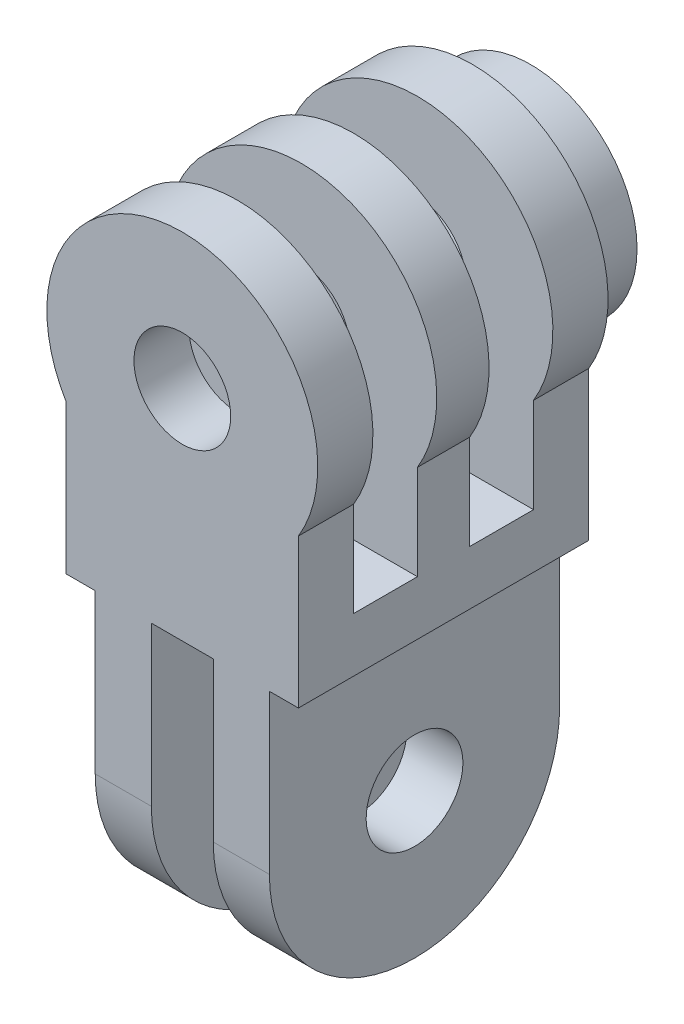
ISO-10303-21;
HEADER;
FILE_DESCRIPTION(('STEP AP214'),'2;1');
FILE_NAME('part.step','',(''),(''),'','','');
FILE_SCHEMA(('AUTOMOTIVE_DESIGN { 1 0 10303 214 1 1 1 1 }'));
ENDSEC;
DATA;
#1=APPLICATION_CONTEXT('core data for automotive mechanical design processes');
#2=APPLICATION_PROTOCOL_DEFINITION('international standard','automotive_design',2000,#1);
#3=PRODUCT_CONTEXT('',#1,'mechanical');
#4=PRODUCT('Part','Part','',(#3));
#5=PRODUCT_RELATED_PRODUCT_CATEGORY('part','',(#4));
#6=PRODUCT_DEFINITION_FORMATION('','',#4);
#7=PRODUCT_DEFINITION_CONTEXT('part definition',#1,'design');
#8=PRODUCT_DEFINITION('design','',#6,#7);
#9=PRODUCT_DEFINITION_SHAPE('','',#8);
#10=(LENGTH_UNIT() NAMED_UNIT(*) SI_UNIT(.MILLI.,.METRE.));
#11=(NAMED_UNIT(*) PLANE_ANGLE_UNIT() SI_UNIT($,.RADIAN.));
#12=(NAMED_UNIT(*) SI_UNIT($,.STERADIAN.) SOLID_ANGLE_UNIT());
#13=UNCERTAINTY_MEASURE_WITH_UNIT(LENGTH_MEASURE(1.E-05),#10,'distance_accuracy_value','');
#14=(GEOMETRIC_REPRESENTATION_CONTEXT(3) GLOBAL_UNCERTAINTY_ASSIGNED_CONTEXT((#13)) GLOBAL_UNIT_ASSIGNED_CONTEXT((#10,
#11,#12)) REPRESENTATION_CONTEXT('',''));
#15=CARTESIAN_POINT('',(0.,0.,0.));
#16=DIRECTION('',(0.,0.,1.));
#17=DIRECTION('',(1.,0.,0.));
#18=AXIS2_PLACEMENT_3D('',#15,#16,#17);
#19=CARTESIAN_POINT('',(0.,0.,0.));
#20=DIRECTION('',(0.,0.,1.));
#21=DIRECTION('',(1.,0.,0.));
#22=AXIS2_PLACEMENT_3D('',#19,#20,#21);
#23=PLANE('',#22);
#24=DIRECTION('',(1.,0.,0.));
#25=VECTOR('',#24,1.);
#26=CARTESIAN_POINT('',(-5.5,-9.50000000000001,0.));
#27=LINE('',#26,#25);
#28=CARTESIAN_POINT('',(-4.5,-9.50000000000001,0.));
#29=VERTEX_POINT('',#28);
#30=CARTESIAN_POINT('',(-1.6,-9.50000000000001,0.));
#31=VERTEX_POINT('',#30);
#32=EDGE_CURVE('E68',#29,#31,#27,.T.);
#33=ORIENTED_EDGE('',*,*,#32,.F.);
#34=DIRECTION('',(0.,-1.,0.));
#35=VECTOR('',#34,1.);
#36=CARTESIAN_POINT('',(-4.5,0.,0.));
#37=LINE('',#36,#35);
#38=CARTESIAN_POINT('',(-4.5,-1.30259838574965,0.));
#39=VERTEX_POINT('',#38);
#40=EDGE_CURVE('E408',#39,#29,#37,.T.);
#41=ORIENTED_EDGE('',*,*,#40,.F.);
#42=DIRECTION('',(1.,0.,0.));
#43=VECTOR('',#42,1.);
#44=CARTESIAN_POINT('',(0.,-1.30259838574965,0.));
#45=LINE('',#44,#43);
#46=CARTESIAN_POINT('',(-6.,-1.30259838574965,0.));
#47=VERTEX_POINT('',#46);
#48=EDGE_CURVE('E406',#47,#39,#45,.T.);
#49=ORIENTED_EDGE('',*,*,#48,.F.);
#50=DIRECTION('',(0.,1.,0.));
#51=VECTOR('',#50,1.);
#52=CARTESIAN_POINT('',(-6.,0.,0.));
#53=LINE('',#52,#51);
#54=CARTESIAN_POINT('',(-6.,6.394448724536,0.));
#55=VERTEX_POINT('',#54);
#56=EDGE_CURVE('E403',#47,#55,#53,.T.);
#57=ORIENTED_EDGE('',*,*,#56,.T.);
#58=CARTESIAN_POINT('',(0.,10.,0.));
#59=DIRECTION('',(0.,0.,1.));
#60=DIRECTION('',(1.,0.,0.));
#61=AXIS2_PLACEMENT_3D('',#58,#59,#60);
#62=CIRCLE('',#61,7.);
#63=CARTESIAN_POINT('',(6.,6.39444872453601,0.));
#64=VERTEX_POINT('',#63);
#65=EDGE_CURVE('E400',#64,#55,#62,.T.);
#66=ORIENTED_EDGE('',*,*,#65,.F.);
#67=DIRECTION('',(0.,1.,0.));
#68=VECTOR('',#67,1.);
#69=CARTESIAN_POINT('',(6.,0.,0.));
#70=LINE('',#69,#68);
#71=CARTESIAN_POINT('',(6.,-1.30259838574965,0.));
#72=VERTEX_POINT('',#71);
#73=EDGE_CURVE('E366',#72,#64,#70,.T.);
#74=ORIENTED_EDGE('',*,*,#73,.F.);
#75=DIRECTION('',(-1.,0.,0.));
#76=VECTOR('',#75,1.);
#77=CARTESIAN_POINT('',(0.,-1.30259838574965,0.));
#78=LINE('',#77,#76);
#79=CARTESIAN_POINT('',(4.5,-1.30259838574965,0.));
#80=VERTEX_POINT('',#79);
#81=EDGE_CURVE('E371',#72,#80,#78,.T.);
#82=ORIENTED_EDGE('',*,*,#81,.T.);
#83=DIRECTION('',(0.,-1.,0.));
#84=VECTOR('',#83,1.);
#85=CARTESIAN_POINT('',(4.5,0.,0.));
#86=LINE('',#85,#84);
#87=CARTESIAN_POINT('',(4.5,-9.50000000000001,0.));
#88=VERTEX_POINT('',#87);
#89=EDGE_CURVE('E418',#80,#88,#86,.T.);
#90=ORIENTED_EDGE('',*,*,#89,.T.);
#91=CARTESIAN_POINT('',(1.6,-9.50000000000001,0.));
#92=VERTEX_POINT('',#91);
#93=EDGE_CURVE('E462',#92,#88,#27,.T.);
#94=ORIENTED_EDGE('',*,*,#93,.F.);
#95=DIRECTION('',(0.,1.,0.));
#96=VECTOR('',#95,1.);
#97=CARTESIAN_POINT('',(1.6,0.,0.));
#98=LINE('',#97,#96);
#99=CARTESIAN_POINT('',(1.6,-1.30259838574965,0.));
#100=VERTEX_POINT('',#99);
#101=EDGE_CURVE('E416',#92,#100,#98,.T.);
#102=ORIENTED_EDGE('',*,*,#101,.T.);
#103=DIRECTION('',(-1.,0.,0.));
#104=VECTOR('',#103,1.);
#105=CARTESIAN_POINT('',(0.,-1.30259838574965,0.));
#106=LINE('',#105,#104);
#107=CARTESIAN_POINT('',(-1.6,-1.30259838574965,0.));
#108=VERTEX_POINT('',#107);
#109=EDGE_CURVE('E413',#100,#108,#106,.T.);
#110=ORIENTED_EDGE('',*,*,#109,.T.);
#111=DIRECTION('',(0.,1.,0.));
#112=VECTOR('',#111,1.);
#113=CARTESIAN_POINT('',(-1.6,0.,0.));
#114=LINE('',#113,#112);
#115=EDGE_CURVE('E411',#31,#108,#114,.T.);
#116=ORIENTED_EDGE('',*,*,#115,.F.);
#117=EDGE_LOOP('',(#33,#41,#49,#57,#66,#74,#82,#90,#94,#102,#110,#116));
#118=FACE_BOUND('',#117,.T.);
#119=CARTESIAN_POINT('',(0.,10.,0.));
#120=DIRECTION('',(0.,0.,1.));
#121=DIRECTION('',(1.,0.,0.));
#122=AXIS2_PLACEMENT_3D('',#119,#120,#121);
#123=CIRCLE('',#122,5.5);
#124=CARTESIAN_POINT('',(5.5,10.,0.));
#125=VERTEX_POINT('',#124);
#126=EDGE_CURVE('E12',#125,#125,#123,.F.);
#127=ORIENTED_EDGE('',*,*,#126,.F.);
#128=EDGE_LOOP('',(#127));
#129=FACE_BOUND('',#128,.T.);
#130=ADVANCED_FACE('F59',(#118,#129),#23,.F.);
#131=CARTESIAN_POINT('',(-4.5,0.,15.));
#132=DIRECTION('',(1.,0.,0.));
#133=DIRECTION('',(0.,1.,0.));
#134=AXIS2_PLACEMENT_3D('',#131,#132,#133);
#135=PLANE('',#134);
#136=CARTESIAN_POINT('',(-4.5,-9.50000000000001,7.5));
#137=DIRECTION('',(1.,0.,0.));
#138=DIRECTION('',(0.,1.,0.));
#139=AXIS2_PLACEMENT_3D('',#136,#137,#138);
#140=CIRCLE('',#139,2.5);
#141=CARTESIAN_POINT('',(-4.5,-7.00000000000001,7.5));
#142=VERTEX_POINT('',#141);
#143=EDGE_CURVE('E299',#142,#142,#140,.T.);
#144=ORIENTED_EDGE('',*,*,#143,.T.);
#145=EDGE_LOOP('',(#144));
#146=FACE_BOUND('',#145,.T.);
#147=ORIENTED_EDGE('',*,*,#40,.T.);
#148=CARTESIAN_POINT('',(-4.5,-9.50000000000001,7.5));
#149=DIRECTION('',(1.,0.,0.));
#150=DIRECTION('',(0.,1.,0.));
#151=AXIS2_PLACEMENT_3D('',#148,#149,#150);
#152=CIRCLE('',#151,7.5);
#153=CARTESIAN_POINT('',(-4.5,-9.50000000000001,15.));
#154=VERTEX_POINT('',#153);
#155=EDGE_CURVE('E308',#154,#29,#152,.T.);
#156=ORIENTED_EDGE('',*,*,#155,.F.);
#157=DIRECTION('',(0.,-1.,0.));
#158=VECTOR('',#157,1.);
#159=CARTESIAN_POINT('',(-4.5,0.,15.));
#160=LINE('',#159,#158);
#161=CARTESIAN_POINT('',(-4.5,-1.30259838574965,15.));
#162=VERTEX_POINT('',#161);
#163=EDGE_CURVE('E378',#162,#154,#160,.T.);
#164=ORIENTED_EDGE('',*,*,#163,.F.);
#165=DIRECTION('',(0.,0.,-1.));
#166=VECTOR('',#165,1.);
#167=CARTESIAN_POINT('',(-4.5,-1.30259838574965,15.));
#168=LINE('',#167,#166);
#169=EDGE_CURVE('E432',#162,#39,#168,.T.);
#170=ORIENTED_EDGE('',*,*,#169,.T.);
#171=EDGE_LOOP('',(#147,#156,#164,#170));
#172=FACE_BOUND('',#171,.T.);
#173=ADVANCED_FACE('F517',(#146,#172),#135,.F.);
#174=CARTESIAN_POINT('',(-1.6,0.,15.));
#175=DIRECTION('',(-1.,0.,0.));
#176=DIRECTION('',(0.,0.,1.));
#177=AXIS2_PLACEMENT_3D('',#174,#175,#176);
#178=PLANE('',#177);
#179=CARTESIAN_POINT('',(-1.6,-9.50000000000001,7.5));
#180=DIRECTION('',(-1.,0.,0.));
#181=DIRECTION('',(0.,0.,1.));
#182=AXIS2_PLACEMENT_3D('',#179,#180,#181);
#183=CIRCLE('',#182,2.5);
#184=CARTESIAN_POINT('',(-1.6,-9.50000000000001,10.));
#185=VERTEX_POINT('',#184);
#186=EDGE_CURVE('E296',#185,#185,#183,.T.);
#187=ORIENTED_EDGE('',*,*,#186,.T.);
#188=EDGE_LOOP('',(#187));
#189=FACE_BOUND('',#188,.T.);
#190=CARTESIAN_POINT('',(-1.6,-9.50000000000001,7.5));
#191=DIRECTION('',(-1.,0.,0.));
#192=DIRECTION('',(0.,0.,1.));
#193=AXIS2_PLACEMENT_3D('',#190,#191,#192);
#194=CIRCLE('',#193,7.5);
#195=CARTESIAN_POINT('',(-1.6,-9.50000000000001,15.));
#196=VERTEX_POINT('',#195);
#197=EDGE_CURVE('E306',#31,#196,#194,.T.);
#198=ORIENTED_EDGE('',*,*,#197,.F.);
#199=ORIENTED_EDGE('',*,*,#115,.T.);
#200=DIRECTION('',(0.,0.,-1.));
#201=VECTOR('',#200,1.);
#202=CARTESIAN_POINT('',(-1.6,-1.30259838574965,15.));
#203=LINE('',#202,#201);
#204=CARTESIAN_POINT('',(-1.6,-1.30259838574965,15.));
#205=VERTEX_POINT('',#204);
#206=EDGE_CURVE('E429',#205,#108,#203,.T.);
#207=ORIENTED_EDGE('',*,*,#206,.F.);
#208=DIRECTION('',(0.,1.,0.));
#209=VECTOR('',#208,1.);
#210=CARTESIAN_POINT('',(-1.6,0.,15.));
#211=LINE('',#210,#209);
#212=EDGE_CURVE('E381',#196,#205,#211,.T.);
#213=ORIENTED_EDGE('',*,*,#212,.F.);
#214=EDGE_LOOP('',(#198,#199,#207,#213));
#215=FACE_BOUND('',#214,.T.);
#216=ADVANCED_FACE('F475',(#189,#215),#178,.F.);
#217=CARTESIAN_POINT('',(1.6,0.,15.));
#218=DIRECTION('',(-1.,0.,0.));
#219=DIRECTION('',(0.,0.,1.));
#220=AXIS2_PLACEMENT_3D('',#217,#218,#219);
#221=PLANE('',#220);
#222=CARTESIAN_POINT('',(1.6,-9.50000000000001,7.5));
#223=DIRECTION('',(-1.,0.,0.));
#224=DIRECTION('',(0.,0.,1.));
#225=AXIS2_PLACEMENT_3D('',#222,#223,#224);
#226=CIRCLE('',#225,2.5);
#227=CARTESIAN_POINT('',(1.6,-9.50000000000001,10.));
#228=VERTEX_POINT('',#227);
#229=EDGE_CURVE('E293',#228,#228,#226,.T.);
#230=ORIENTED_EDGE('',*,*,#229,.F.);
#231=EDGE_LOOP('',(#230));
#232=FACE_BOUND('',#231,.T.);
#233=ORIENTED_EDGE('',*,*,#101,.F.);
#234=CARTESIAN_POINT('',(1.6,-9.50000000000001,7.5));
#235=DIRECTION('',(-1.,0.,0.));
#236=DIRECTION('',(0.,0.,1.));
#237=AXIS2_PLACEMENT_3D('',#234,#235,#236);
#238=CIRCLE('',#237,7.5);
#239=CARTESIAN_POINT('',(1.6,-9.50000000000001,15.));
#240=VERTEX_POINT('',#239);
#241=EDGE_CURVE('E303',#92,#240,#238,.T.);
#242=ORIENTED_EDGE('',*,*,#241,.T.);
#243=DIRECTION('',(0.,1.,0.));
#244=VECTOR('',#243,1.);
#245=CARTESIAN_POINT('',(1.6,0.,15.));
#246=LINE('',#245,#244);
#247=CARTESIAN_POINT('',(1.6,-1.30259838574965,15.));
#248=VERTEX_POINT('',#247);
#249=EDGE_CURVE('E386',#240,#248,#246,.T.);
#250=ORIENTED_EDGE('',*,*,#249,.T.);
#251=DIRECTION('',(0.,0.,-1.));
#252=VECTOR('',#251,1.);
#253=CARTESIAN_POINT('',(1.6,-1.30259838574965,15.));
#254=LINE('',#253,#252);
#255=EDGE_CURVE('E426',#248,#100,#254,.T.);
#256=ORIENTED_EDGE('',*,*,#255,.T.);
#257=EDGE_LOOP('',(#233,#242,#250,#256));
#258=FACE_BOUND('',#257,.T.);
#259=ADVANCED_FACE('F485',(#232,#258),#221,.T.);
#260=CARTESIAN_POINT('',(4.5,0.,15.));
#261=DIRECTION('',(1.,0.,0.));
#262=DIRECTION('',(0.,1.,0.));
#263=AXIS2_PLACEMENT_3D('',#260,#261,#262);
#264=PLANE('',#263);
#265=CARTESIAN_POINT('',(4.5,-9.50000000000001,7.5));
#266=DIRECTION('',(1.,0.,0.));
#267=DIRECTION('',(0.,1.,0.));
#268=AXIS2_PLACEMENT_3D('',#265,#266,#267);
#269=CIRCLE('',#268,2.5);
#270=CARTESIAN_POINT('',(4.5,-7.,7.5));
#271=VERTEX_POINT('',#270);
#272=EDGE_CURVE('E290',#271,#271,#269,.T.);
#273=ORIENTED_EDGE('',*,*,#272,.F.);
#274=EDGE_LOOP('',(#273));
#275=FACE_BOUND('',#274,.T.);
#276=CARTESIAN_POINT('',(4.5,-9.50000000000001,7.5));
#277=DIRECTION('',(1.,0.,0.));
#278=DIRECTION('',(0.,1.,0.));
#279=AXIS2_PLACEMENT_3D('',#276,#277,#278);
#280=CIRCLE('',#279,7.5);
#281=CARTESIAN_POINT('',(4.5,-9.50000000000001,15.));
#282=VERTEX_POINT('',#281);
#283=EDGE_CURVE('E83',#282,#88,#280,.T.);
#284=ORIENTED_EDGE('',*,*,#283,.T.);
#285=ORIENTED_EDGE('',*,*,#89,.F.);
#286=DIRECTION('',(0.,0.,-1.));
#287=VECTOR('',#286,1.);
#288=CARTESIAN_POINT('',(4.5,-1.30259838574965,15.));
#289=LINE('',#288,#287);
#290=CARTESIAN_POINT('',(4.5,-1.30259838574965,15.));
#291=VERTEX_POINT('',#290);
#292=EDGE_CURVE('E424',#291,#80,#289,.T.);
#293=ORIENTED_EDGE('',*,*,#292,.F.);
#294=DIRECTION('',(0.,-1.,0.));
#295=VECTOR('',#294,1.);
#296=CARTESIAN_POINT('',(4.5,0.,15.));
#297=LINE('',#296,#295);
#298=EDGE_CURVE('E388',#291,#282,#297,.T.);
#299=ORIENTED_EDGE('',*,*,#298,.T.);
#300=EDGE_LOOP('',(#284,#285,#293,#299));
#301=FACE_BOUND('',#300,.T.);
#302=ADVANCED_FACE('F494',(#275,#301),#264,.T.);
#303=CARTESIAN_POINT('',(0.,0.,15.));
#304=DIRECTION('',(0.,0.,1.));
#305=DIRECTION('',(1.,0.,0.));
#306=AXIS2_PLACEMENT_3D('',#303,#304,#305);
#307=PLANE('',#306);
#308=CARTESIAN_POINT('',(0.,10.,15.));
#309=DIRECTION('',(0.,0.,1.));
#310=DIRECTION('',(1.,0.,0.));
#311=AXIS2_PLACEMENT_3D('',#308,#309,#310);
#312=CIRCLE('',#311,2.5);
#313=CARTESIAN_POINT('',(2.5,10.,15.));
#314=VERTEX_POINT('',#313);
#315=EDGE_CURVE('E394',#314,#314,#312,.T.);
#316=ORIENTED_EDGE('',*,*,#315,.F.);
#317=EDGE_LOOP('',(#316));
#318=FACE_BOUND('',#317,.T.);
#319=ORIENTED_EDGE('',*,*,#163,.T.);
#320=DIRECTION('',(1.,0.,0.));
#321=VECTOR('',#320,1.);
#322=CARTESIAN_POINT('',(-5.5,-9.50000000000001,15.));
#323=LINE('',#322,#321);
#324=EDGE_CURVE('E461',#154,#196,#323,.T.);
#325=ORIENTED_EDGE('',*,*,#324,.T.);
#326=ORIENTED_EDGE('',*,*,#212,.T.);
#327=DIRECTION('',(-1.,0.,0.));
#328=VECTOR('',#327,1.);
#329=CARTESIAN_POINT('',(0.,-1.30259838574965,15.));
#330=LINE('',#329,#328);
#331=EDGE_CURVE('E383',#248,#205,#330,.T.);
#332=ORIENTED_EDGE('',*,*,#331,.F.);
#333=ORIENTED_EDGE('',*,*,#249,.F.);
#334=EDGE_CURVE('E459',#240,#282,#323,.T.);
#335=ORIENTED_EDGE('',*,*,#334,.T.);
#336=ORIENTED_EDGE('',*,*,#298,.F.);
#337=DIRECTION('',(-1.,0.,0.));
#338=VECTOR('',#337,1.);
#339=CARTESIAN_POINT('',(0.,-1.30259838574965,15.));
#340=LINE('',#339,#338);
#341=CARTESIAN_POINT('',(6.,-1.30259838574965,15.));
#342=VERTEX_POINT('',#341);
#343=EDGE_CURVE('E391',#342,#291,#340,.T.);
#344=ORIENTED_EDGE('',*,*,#343,.F.);
#345=DIRECTION('',(0.,1.,0.));
#346=VECTOR('',#345,1.);
#347=CARTESIAN_POINT('',(6.,0.,15.));
#348=LINE('',#347,#346);
#349=CARTESIAN_POINT('',(6.,6.39444872453601,15.));
#350=VERTEX_POINT('',#349);
#351=EDGE_CURVE('E367',#342,#350,#348,.T.);
#352=ORIENTED_EDGE('',*,*,#351,.T.);
#353=CARTESIAN_POINT('',(0.,10.,15.));
#354=DIRECTION('',(0.,0.,1.));
#355=DIRECTION('',(1.,0.,0.));
#356=AXIS2_PLACEMENT_3D('',#353,#354,#355);
#357=CIRCLE('',#356,7.);
#358=CARTESIAN_POINT('',(-6.,6.394448724536,15.));
#359=VERTEX_POINT('',#358);
#360=EDGE_CURVE('E370',#350,#359,#357,.T.);
#361=ORIENTED_EDGE('',*,*,#360,.T.);
#362=DIRECTION('',(0.,1.,0.));
#363=VECTOR('',#362,1.);
#364=CARTESIAN_POINT('',(-6.,0.,15.));
#365=LINE('',#364,#363);
#366=CARTESIAN_POINT('',(-6.,-1.30259838574965,15.));
#367=VERTEX_POINT('',#366);
#368=EDGE_CURVE('E373',#367,#359,#365,.T.);
#369=ORIENTED_EDGE('',*,*,#368,.F.);
#370=DIRECTION('',(1.,0.,0.));
#371=VECTOR('',#370,1.);
#372=CARTESIAN_POINT('',(0.,-1.30259838574965,15.));
#373=LINE('',#372,#371);
#374=EDGE_CURVE('E376',#367,#162,#373,.T.);
#375=ORIENTED_EDGE('',*,*,#374,.T.);
#376=EDGE_LOOP('',(#319,#325,#326,#332,#333,#335,#336,#344,#352,#361,#369,#375));
#377=FACE_BOUND('',#376,.T.);
#378=ADVANCED_FACE('F468',(#318,#377),#307,.T.);
#379=CARTESIAN_POINT('',(0.,10.,15.));
#380=DIRECTION('',(0.,0.,-1.));
#381=DIRECTION('',(-1.,0.,0.));
#382=AXIS2_PLACEMENT_3D('',#379,#380,#381);
#383=CYLINDRICAL_SURFACE('',#382,7.);
#384=DIRECTION('',(0.,0.,-1.));
#385=VECTOR('',#384,1.);
#386=CARTESIAN_POINT('',(-6.,6.394448724536,15.));
#387=LINE('',#386,#385);
#388=CARTESIAN_POINT('',(-6.,6.394448724536,2.85));
#389=VERTEX_POINT('',#388);
#390=EDGE_CURVE('E437',#389,#55,#387,.T.);
#391=ORIENTED_EDGE('',*,*,#390,.F.);
#392=CARTESIAN_POINT('',(0.,10.,2.85));
#393=DIRECTION('',(0.,0.,-1.));
#394=DIRECTION('',(0.,1.,0.));
#395=AXIS2_PLACEMENT_3D('',#392,#393,#394);
#396=CIRCLE('',#395,7.);
#397=CARTESIAN_POINT('',(6.,6.39444872453601,2.85));
#398=VERTEX_POINT('',#397);
#399=EDGE_CURVE('E320',#389,#398,#396,.T.);
#400=ORIENTED_EDGE('',*,*,#399,.T.);
#401=DIRECTION('',(0.,0.,-1.));
#402=VECTOR('',#401,1.);
#403=CARTESIAN_POINT('',(6.,6.39444872453601,15.));
#404=LINE('',#403,#402);
#405=EDGE_CURVE('E441',#398,#64,#404,.T.);
#406=ORIENTED_EDGE('',*,*,#405,.T.);
#407=ORIENTED_EDGE('',*,*,#65,.T.);
#408=EDGE_LOOP('',(#391,#400,#406,#407));
#409=FACE_BOUND('',#408,.T.);
#410=ADVANCED_FACE('F538',(#409),#383,.T.);
#411=CARTESIAN_POINT('',(0.,10.,15.));
#412=DIRECTION('',(0.,0.,-1.));
#413=DIRECTION('',(-1.,0.,0.));
#414=AXIS2_PLACEMENT_3D('',#411,#412,#413);
#415=CYLINDRICAL_SURFACE('',#414,2.5);
#416=CARTESIAN_POINT('',(0.,10.,6.15));
#417=DIRECTION('',(0.,0.,1.));
#418=DIRECTION('',(0.,-1.,0.));
#419=AXIS2_PLACEMENT_3D('',#416,#417,#418);
#420=CIRCLE('',#419,2.5);
#421=CARTESIAN_POINT('',(0.,7.49999999999999,6.15));
#422=VERTEX_POINT('',#421);
#423=EDGE_CURVE('E326',#422,#422,#420,.T.);
#424=ORIENTED_EDGE('',*,*,#423,.F.);
#425=EDGE_LOOP('',(#424));
#426=FACE_BOUND('',#425,.T.);
#427=CARTESIAN_POINT('',(0.,10.,8.85));
#428=DIRECTION('',(0.,0.,-1.));
#429=DIRECTION('',(0.,1.,0.));
#430=AXIS2_PLACEMENT_3D('',#427,#428,#429);
#431=CIRCLE('',#430,2.5);
#432=CARTESIAN_POINT('',(0.,12.5,8.85));
#433=VERTEX_POINT('',#432);
#434=EDGE_CURVE('E342',#433,#433,#431,.T.);
#435=ORIENTED_EDGE('',*,*,#434,.F.);
#436=EDGE_LOOP('',(#435));
#437=FACE_BOUND('',#436,.T.);
#438=ADVANCED_FACE('F567',(#426,#437),#415,.F.);
#439=CARTESIAN_POINT('',(0.,10.,6.15));
#440=DIRECTION('',(0.,0.,1.));
#441=DIRECTION('',(0.,-1.,0.));
#442=AXIS2_PLACEMENT_3D('',#439,#440,#441);
#443=CIRCLE('',#442,7.);
#444=CARTESIAN_POINT('',(6.,6.39444872453601,6.15));
#445=VERTEX_POINT('',#444);
#446=CARTESIAN_POINT('',(-6.,6.394448724536,6.15));
#447=VERTEX_POINT('',#446);
#448=EDGE_CURVE('E330',#445,#447,#443,.T.);
#449=ORIENTED_EDGE('',*,*,#448,.T.);
#450=CARTESIAN_POINT('',(-6.,6.394448724536,8.85));
#451=VERTEX_POINT('',#450);
#452=EDGE_CURVE('E442',#451,#447,#387,.T.);
#453=ORIENTED_EDGE('',*,*,#452,.F.);
#454=CARTESIAN_POINT('',(0.,10.,8.85));
#455=DIRECTION('',(0.,0.,-1.));
#456=DIRECTION('',(0.,1.,0.));
#457=AXIS2_PLACEMENT_3D('',#454,#455,#456);
#458=CIRCLE('',#457,7.);
#459=CARTESIAN_POINT('',(6.,6.39444872453601,8.85));
#460=VERTEX_POINT('',#459);
#461=EDGE_CURVE('E348',#451,#460,#458,.T.);
#462=ORIENTED_EDGE('',*,*,#461,.T.);
#463=EDGE_CURVE('E447',#460,#445,#404,.T.);
#464=ORIENTED_EDGE('',*,*,#463,.T.);
#465=EDGE_LOOP('',(#449,#453,#462,#464));
#466=FACE_BOUND('',#465,.T.);
#467=ADVANCED_FACE('F526',(#466),#383,.T.);
#468=CARTESIAN_POINT('',(0.,10.,12.15));
#469=DIRECTION('',(0.,0.,1.));
#470=DIRECTION('',(0.,-1.,0.));
#471=AXIS2_PLACEMENT_3D('',#468,#469,#470);
#472=CIRCLE('',#471,2.5);
#473=CARTESIAN_POINT('',(0.,7.49999999999999,12.15));
#474=VERTEX_POINT('',#473);
#475=EDGE_CURVE('E354',#474,#474,#472,.T.);
#476=ORIENTED_EDGE('',*,*,#475,.F.);
#477=EDGE_LOOP('',(#476));
#478=FACE_BOUND('',#477,.T.);
#479=ORIENTED_EDGE('',*,*,#315,.T.);
#480=EDGE_LOOP('',(#479));
#481=FACE_BOUND('',#480,.T.);
#482=ADVANCED_FACE('F568',(#478,#481),#415,.F.);
#483=CARTESIAN_POINT('',(6.,0.,15.));
#484=DIRECTION('',(-1.,0.,0.));
#485=DIRECTION('',(0.,0.,1.));
#486=AXIS2_PLACEMENT_3D('',#483,#484,#485);
#487=PLANE('',#486);
#488=DIRECTION('',(0.,0.,1.));
#489=VECTOR('',#488,1.);
#490=CARTESIAN_POINT('',(6.,1.5,15.));
#491=LINE('',#490,#489);
#492=CARTESIAN_POINT('',(6.,1.5,2.85));
#493=VERTEX_POINT('',#492);
#494=CARTESIAN_POINT('',(6.,1.5,6.15));
#495=VERTEX_POINT('',#494);
#496=EDGE_CURVE('E335',#493,#495,#491,.T.);
#497=ORIENTED_EDGE('',*,*,#496,.T.);
#498=DIRECTION('',(0.,1.,0.));
#499=VECTOR('',#498,1.);
#500=CARTESIAN_POINT('',(6.,0.,6.15));
#501=LINE('',#500,#499);
#502=EDGE_CURVE('E332',#495,#445,#501,.T.);
#503=ORIENTED_EDGE('',*,*,#502,.T.);
#504=ORIENTED_EDGE('',*,*,#463,.F.);
#505=DIRECTION('',(0.,-1.,0.));
#506=VECTOR('',#505,1.);
#507=CARTESIAN_POINT('',(6.,0.,8.85));
#508=LINE('',#507,#506);
#509=CARTESIAN_POINT('',(6.,1.5,8.85));
#510=VERTEX_POINT('',#509);
#511=EDGE_CURVE('E351',#460,#510,#508,.T.);
#512=ORIENTED_EDGE('',*,*,#511,.T.);
#513=DIRECTION('',(0.,0.,1.));
#514=VECTOR('',#513,1.);
#515=CARTESIAN_POINT('',(6.,1.5,15.));
#516=LINE('',#515,#514);
#517=CARTESIAN_POINT('',(6.,1.5,12.15));
#518=VERTEX_POINT('',#517);
#519=EDGE_CURVE('E363',#510,#518,#516,.T.);
#520=ORIENTED_EDGE('',*,*,#519,.T.);
#521=DIRECTION('',(0.,1.,0.));
#522=VECTOR('',#521,1.);
#523=CARTESIAN_POINT('',(6.,0.,12.15));
#524=LINE('',#523,#522);
#525=CARTESIAN_POINT('',(6.,6.39444872453601,12.15));
#526=VERTEX_POINT('',#525);
#527=EDGE_CURVE('E360',#518,#526,#524,.T.);
#528=ORIENTED_EDGE('',*,*,#527,.T.);
#529=EDGE_CURVE('E443',#350,#526,#404,.T.);
#530=ORIENTED_EDGE('',*,*,#529,.F.);
#531=ORIENTED_EDGE('',*,*,#351,.F.);
#532=DIRECTION('',(0.,0.,-1.));
#533=VECTOR('',#532,1.);
#534=CARTESIAN_POINT('',(6.,-1.30259838574965,15.));
#535=LINE('',#534,#533);
#536=EDGE_CURVE('E397',#342,#72,#535,.T.);
#537=ORIENTED_EDGE('',*,*,#536,.T.);
#538=ORIENTED_EDGE('',*,*,#73,.T.);
#539=ORIENTED_EDGE('',*,*,#405,.F.);
#540=DIRECTION('',(0.,-1.,0.));
#541=VECTOR('',#540,1.);
#542=CARTESIAN_POINT('',(6.,0.,2.85));
#543=LINE('',#542,#541);
#544=EDGE_CURVE('E323',#398,#493,#543,.T.);
#545=ORIENTED_EDGE('',*,*,#544,.T.);
#546=EDGE_LOOP('',(#497,#503,#504,#512,#520,#528,#530,#531,#537,#538,#539,#545));
#547=FACE_BOUND('',#546,.T.);
#548=ADVANCED_FACE('F61',(#547),#487,.F.);
#549=CARTESIAN_POINT('',(0.,10.,12.15));
#550=DIRECTION('',(0.,0.,1.));
#551=DIRECTION('',(0.,-1.,0.));
#552=AXIS2_PLACEMENT_3D('',#549,#550,#551);
#553=CIRCLE('',#552,7.);
#554=CARTESIAN_POINT('',(-6.,6.394448724536,12.15));
#555=VERTEX_POINT('',#554);
#556=EDGE_CURVE('E358',#526,#555,#553,.T.);
#557=ORIENTED_EDGE('',*,*,#556,.T.);
#558=EDGE_CURVE('E438',#359,#555,#387,.T.);
#559=ORIENTED_EDGE('',*,*,#558,.F.);
#560=ORIENTED_EDGE('',*,*,#360,.F.);
#561=ORIENTED_EDGE('',*,*,#529,.T.);
#562=EDGE_LOOP('',(#557,#559,#560,#561));
#563=FACE_BOUND('',#562,.T.);
#564=ADVANCED_FACE('F504',(#563),#383,.T.);
#565=CARTESIAN_POINT('',(-6.,0.,15.));
#566=DIRECTION('',(-1.,0.,0.));
#567=DIRECTION('',(0.,0.,1.));
#568=AXIS2_PLACEMENT_3D('',#565,#566,#567);
#569=PLANE('',#568);
#570=DIRECTION('',(0.,1.,0.));
#571=VECTOR('',#570,1.);
#572=CARTESIAN_POINT('',(-6.,0.,6.15));
#573=LINE('',#572,#571);
#574=CARTESIAN_POINT('',(-6.,1.5,6.15));
#575=VERTEX_POINT('',#574);
#576=EDGE_CURVE('E327',#575,#447,#573,.T.);
#577=ORIENTED_EDGE('',*,*,#576,.F.);
#578=DIRECTION('',(0.,0.,1.));
#579=VECTOR('',#578,1.);
#580=CARTESIAN_POINT('',(-6.,1.5,15.));
#581=LINE('',#580,#579);
#582=CARTESIAN_POINT('',(-6.,1.5,2.85));
#583=VERTEX_POINT('',#582);
#584=EDGE_CURVE('E453',#583,#575,#581,.T.);
#585=ORIENTED_EDGE('',*,*,#584,.F.);
#586=DIRECTION('',(0.,-1.,0.));
#587=VECTOR('',#586,1.);
#588=CARTESIAN_POINT('',(-6.,0.,2.85));
#589=LINE('',#588,#587);
#590=EDGE_CURVE('E317',#389,#583,#589,.T.);
#591=ORIENTED_EDGE('',*,*,#590,.F.);
#592=ORIENTED_EDGE('',*,*,#390,.T.);
#593=ORIENTED_EDGE('',*,*,#56,.F.);
#594=DIRECTION('',(0.,0.,-1.));
#595=VECTOR('',#594,1.);
#596=CARTESIAN_POINT('',(-6.,-1.30259838574965,15.));
#597=LINE('',#596,#595);
#598=EDGE_CURVE('E435',#367,#47,#597,.T.);
#599=ORIENTED_EDGE('',*,*,#598,.F.);
#600=ORIENTED_EDGE('',*,*,#368,.T.);
#601=ORIENTED_EDGE('',*,*,#558,.T.);
#602=DIRECTION('',(0.,1.,0.));
#603=VECTOR('',#602,1.);
#604=CARTESIAN_POINT('',(-6.,0.,12.15));
#605=LINE('',#604,#603);
#606=CARTESIAN_POINT('',(-6.,1.5,12.15));
#607=VERTEX_POINT('',#606);
#608=EDGE_CURVE('E355',#607,#555,#605,.T.);
#609=ORIENTED_EDGE('',*,*,#608,.F.);
#610=DIRECTION('',(0.,0.,1.));
#611=VECTOR('',#610,1.);
#612=CARTESIAN_POINT('',(-6.,1.5,15.));
#613=LINE('',#612,#611);
#614=CARTESIAN_POINT('',(-6.,1.5,8.85));
#615=VERTEX_POINT('',#614);
#616=EDGE_CURVE('E446',#615,#607,#613,.T.);
#617=ORIENTED_EDGE('',*,*,#616,.F.);
#618=DIRECTION('',(0.,-1.,0.));
#619=VECTOR('',#618,1.);
#620=CARTESIAN_POINT('',(-6.,0.,8.85));
#621=LINE('',#620,#619);
#622=EDGE_CURVE('E345',#451,#615,#621,.T.);
#623=ORIENTED_EDGE('',*,*,#622,.F.);
#624=ORIENTED_EDGE('',*,*,#452,.T.);
#625=EDGE_LOOP('',(#577,#585,#591,#592,#593,#599,#600,#601,#609,#617,#623,#624));
#626=FACE_BOUND('',#625,.T.);
#627=ADVANCED_FACE('F508',(#626),#569,.T.);
#628=CARTESIAN_POINT('',(0.,-1.30259838574965,15.));
#629=DIRECTION('',(0.,1.,0.));
#630=DIRECTION('',(-1.,0.,0.));
#631=AXIS2_PLACEMENT_3D('',#628,#629,#630);
#632=PLANE('',#631);
#633=ORIENTED_EDGE('',*,*,#48,.T.);
#634=ORIENTED_EDGE('',*,*,#169,.F.);
#635=ORIENTED_EDGE('',*,*,#374,.F.);
#636=ORIENTED_EDGE('',*,*,#598,.T.);
#637=EDGE_LOOP('',(#633,#634,#635,#636));
#638=FACE_BOUND('',#637,.T.);
#639=ADVANCED_FACE('F514',(#638),#632,.F.);
#640=CARTESIAN_POINT('',(0.,-1.30259838574965,15.));
#641=DIRECTION('',(0.,-1.,0.));
#642=DIRECTION('',(1.,0.,0.));
#643=AXIS2_PLACEMENT_3D('',#640,#641,#642);
#644=PLANE('',#643);
#645=ORIENTED_EDGE('',*,*,#109,.F.);
#646=ORIENTED_EDGE('',*,*,#255,.F.);
#647=ORIENTED_EDGE('',*,*,#331,.T.);
#648=ORIENTED_EDGE('',*,*,#206,.T.);
#649=EDGE_LOOP('',(#645,#646,#647,#648));
#650=FACE_BOUND('',#649,.T.);
#651=ADVANCED_FACE('F480',(#650),#644,.T.);
#652=CARTESIAN_POINT('',(0.,-1.30259838574965,15.));
#653=DIRECTION('',(0.,-1.,0.));
#654=DIRECTION('',(1.,0.,0.));
#655=AXIS2_PLACEMENT_3D('',#652,#653,#654);
#656=PLANE('',#655);
#657=ORIENTED_EDGE('',*,*,#81,.F.);
#658=ORIENTED_EDGE('',*,*,#536,.F.);
#659=ORIENTED_EDGE('',*,*,#343,.T.);
#660=ORIENTED_EDGE('',*,*,#292,.T.);
#661=EDGE_LOOP('',(#657,#658,#659,#660));
#662=FACE_BOUND('',#661,.T.);
#663=ADVANCED_FACE('F497',(#662),#656,.T.);
#664=CARTESIAN_POINT('',(0.,10.,0.));
#665=DIRECTION('',(0.,0.,1.));
#666=DIRECTION('',(1.,0.,0.));
#667=AXIS2_PLACEMENT_3D('',#664,#665,#666);
#668=CIRCLE('',#667,2.5);
#669=CARTESIAN_POINT('',(2.5,10.,0.));
#670=VERTEX_POINT('',#669);
#671=EDGE_CURVE('E63',#670,#670,#668,.T.);
#672=ORIENTED_EDGE('',*,*,#671,.F.);
#673=EDGE_LOOP('',(#672));
#674=FACE_BOUND('',#673,.T.);
#675=CARTESIAN_POINT('',(0.,10.,2.85));
#676=DIRECTION('',(0.,0.,-1.));
#677=DIRECTION('',(0.,1.,0.));
#678=AXIS2_PLACEMENT_3D('',#675,#676,#677);
#679=CIRCLE('',#678,2.5);
#680=CARTESIAN_POINT('',(0.,12.5,2.85));
#681=VERTEX_POINT('',#680);
#682=EDGE_CURVE('E314',#681,#681,#679,.T.);
#683=ORIENTED_EDGE('',*,*,#682,.F.);
#684=EDGE_LOOP('',(#683));
#685=FACE_BOUND('',#684,.T.);
#686=ADVANCED_FACE('F562',(#674,#685),#415,.F.);
#687=CARTESIAN_POINT('',(-7.,1.5,12.15));
#688=DIRECTION('',(0.,-1.,0.));
#689=DIRECTION('',(1.,0.,0.));
#690=AXIS2_PLACEMENT_3D('',#687,#688,#689);
#691=PLANE('',#690);
#692=DIRECTION('',(1.,0.,0.));
#693=VECTOR('',#692,1.);
#694=CARTESIAN_POINT('',(-7.,1.5,8.85));
#695=LINE('',#694,#693);
#696=EDGE_CURVE('E339',#615,#510,#695,.T.);
#697=ORIENTED_EDGE('',*,*,#696,.F.);
#698=ORIENTED_EDGE('',*,*,#616,.T.);
#699=DIRECTION('',(1.,0.,0.));
#700=VECTOR('',#699,1.);
#701=CARTESIAN_POINT('',(-7.,1.5,12.15));
#702=LINE('',#701,#700);
#703=EDGE_CURVE('E338',#607,#518,#702,.T.);
#704=ORIENTED_EDGE('',*,*,#703,.T.);
#705=ORIENTED_EDGE('',*,*,#519,.F.);
#706=EDGE_LOOP('',(#697,#698,#704,#705));
#707=FACE_BOUND('',#706,.T.);
#708=ADVANCED_FACE('F565',(#707),#691,.F.);
#709=CARTESIAN_POINT('',(-7.00000000000001,17.,12.15));
#710=DIRECTION('',(0.,0.,1.));
#711=DIRECTION('',(0.,-1.,0.));
#712=AXIS2_PLACEMENT_3D('',#709,#710,#711);
#713=PLANE('',#712);
#714=ORIENTED_EDGE('',*,*,#475,.T.);
#715=EDGE_LOOP('',(#714));
#716=FACE_BOUND('',#715,.T.);
#717=ORIENTED_EDGE('',*,*,#703,.F.);
#718=ORIENTED_EDGE('',*,*,#608,.T.);
#719=ORIENTED_EDGE('',*,*,#556,.F.);
#720=ORIENTED_EDGE('',*,*,#527,.F.);
#721=EDGE_LOOP('',(#717,#718,#719,#720));
#722=FACE_BOUND('',#721,.T.);
#723=ADVANCED_FACE('F606',(#716,#722),#713,.F.);
#724=CARTESIAN_POINT('',(-7.00000000000001,17.,8.85));
#725=DIRECTION('',(0.,0.,-1.));
#726=DIRECTION('',(0.,1.,0.));
#727=AXIS2_PLACEMENT_3D('',#724,#725,#726);
#728=PLANE('',#727);
#729=ORIENTED_EDGE('',*,*,#434,.T.);
#730=EDGE_LOOP('',(#729));
#731=FACE_BOUND('',#730,.T.);
#732=ORIENTED_EDGE('',*,*,#461,.F.);
#733=ORIENTED_EDGE('',*,*,#622,.T.);
#734=ORIENTED_EDGE('',*,*,#696,.T.);
#735=ORIENTED_EDGE('',*,*,#511,.F.);
#736=EDGE_LOOP('',(#732,#733,#734,#735));
#737=FACE_BOUND('',#736,.T.);
#738=ADVANCED_FACE('F603',(#731,#737),#728,.F.);
#739=CARTESIAN_POINT('',(-7.,1.5,6.15));
#740=DIRECTION('',(0.,-1.,0.));
#741=DIRECTION('',(1.,0.,0.));
#742=AXIS2_PLACEMENT_3D('',#739,#740,#741);
#743=PLANE('',#742);
#744=DIRECTION('',(1.,0.,0.));
#745=VECTOR('',#744,1.);
#746=CARTESIAN_POINT('',(-7.,1.5,2.85));
#747=LINE('',#746,#745);
#748=EDGE_CURVE('E311',#583,#493,#747,.T.);
#749=ORIENTED_EDGE('',*,*,#748,.F.);
#750=ORIENTED_EDGE('',*,*,#584,.T.);
#751=DIRECTION('',(1.,0.,0.));
#752=VECTOR('',#751,1.);
#753=CARTESIAN_POINT('',(-7.,1.5,6.15));
#754=LINE('',#753,#752);
#755=EDGE_CURVE('E310',#575,#495,#754,.T.);
#756=ORIENTED_EDGE('',*,*,#755,.T.);
#757=ORIENTED_EDGE('',*,*,#496,.F.);
#758=EDGE_LOOP('',(#749,#750,#756,#757));
#759=FACE_BOUND('',#758,.T.);
#760=ADVANCED_FACE('F532',(#759),#743,.F.);
#761=CARTESIAN_POINT('',(-7.00000000000001,17.,6.15));
#762=DIRECTION('',(0.,0.,1.));
#763=DIRECTION('',(0.,-1.,0.));
#764=AXIS2_PLACEMENT_3D('',#761,#762,#763);
#765=PLANE('',#764);
#766=ORIENTED_EDGE('',*,*,#423,.T.);
#767=EDGE_LOOP('',(#766));
#768=FACE_BOUND('',#767,.T.);
#769=ORIENTED_EDGE('',*,*,#755,.F.);
#770=ORIENTED_EDGE('',*,*,#576,.T.);
#771=ORIENTED_EDGE('',*,*,#448,.F.);
#772=ORIENTED_EDGE('',*,*,#502,.F.);
#773=EDGE_LOOP('',(#769,#770,#771,#772));
#774=FACE_BOUND('',#773,.T.);
#775=ADVANCED_FACE('F530',(#768,#774),#765,.F.);
#776=CARTESIAN_POINT('',(-7.00000000000001,17.,2.85));
#777=DIRECTION('',(0.,0.,-1.));
#778=DIRECTION('',(0.,1.,0.));
#779=AXIS2_PLACEMENT_3D('',#776,#777,#778);
#780=PLANE('',#779);
#781=ORIENTED_EDGE('',*,*,#682,.T.);
#782=EDGE_LOOP('',(#781));
#783=FACE_BOUND('',#782,.T.);
#784=ORIENTED_EDGE('',*,*,#399,.F.);
#785=ORIENTED_EDGE('',*,*,#590,.T.);
#786=ORIENTED_EDGE('',*,*,#748,.T.);
#787=ORIENTED_EDGE('',*,*,#544,.F.);
#788=EDGE_LOOP('',(#784,#785,#786,#787));
#789=FACE_BOUND('',#788,.T.);
#790=ADVANCED_FACE('F540',(#783,#789),#780,.F.);
#791=CARTESIAN_POINT('',(-5.5,-9.50000000000001,7.5));
#792=DIRECTION('',(1.,0.,0.));
#793=DIRECTION('',(0.,1.,0.));
#794=AXIS2_PLACEMENT_3D('',#791,#792,#793);
#795=CYLINDRICAL_SURFACE('',#794,7.5);
#796=ORIENTED_EDGE('',*,*,#241,.F.);
#797=ORIENTED_EDGE('',*,*,#93,.T.);
#798=ORIENTED_EDGE('',*,*,#283,.F.);
#799=ORIENTED_EDGE('',*,*,#334,.F.);
#800=EDGE_LOOP('',(#796,#797,#798,#799));
#801=FACE_BOUND('',#800,.T.);
#802=ADVANCED_FACE('F486',(#801),#795,.T.);
#803=ORIENTED_EDGE('',*,*,#155,.T.);
#804=ORIENTED_EDGE('',*,*,#32,.T.);
#805=ORIENTED_EDGE('',*,*,#197,.T.);
#806=ORIENTED_EDGE('',*,*,#324,.F.);
#807=EDGE_LOOP('',(#803,#804,#805,#806));
#808=FACE_BOUND('',#807,.T.);
#809=ADVANCED_FACE('F518',(#808),#795,.T.);
#810=CARTESIAN_POINT('',(-5.5,-9.50000000000001,7.5));
#811=DIRECTION('',(1.,0.,0.));
#812=DIRECTION('',(0.,1.,0.));
#813=AXIS2_PLACEMENT_3D('',#810,#811,#812);
#814=CYLINDRICAL_SURFACE('',#813,2.5);
#815=ORIENTED_EDGE('',*,*,#229,.T.);
#816=EDGE_LOOP('',(#815));
#817=FACE_BOUND('',#816,.T.);
#818=ORIENTED_EDGE('',*,*,#272,.T.);
#819=EDGE_LOOP('',(#818));
#820=FACE_BOUND('',#819,.T.);
#821=ADVANCED_FACE('F681',(#817,#820),#814,.F.);
#822=ORIENTED_EDGE('',*,*,#186,.F.);
#823=EDGE_LOOP('',(#822));
#824=FACE_BOUND('',#823,.T.);
#825=ORIENTED_EDGE('',*,*,#143,.F.);
#826=EDGE_LOOP('',(#825));
#827=FACE_BOUND('',#826,.T.);
#828=ADVANCED_FACE('F689',(#824,#827),#814,.F.);
#829=CARTESIAN_POINT('',(0.,10.,-3.));
#830=DIRECTION('',(0.,0.,-1.));
#831=DIRECTION('',(-1.,0.,0.));
#832=AXIS2_PLACEMENT_3D('',#829,#830,#831);
#833=PLANE('',#832);
#834=DIRECTION('',(0.86602540378444,-0.499999999999998,0.));
#835=VECTOR('',#834,1.);
#836=CARTESIAN_POINT('',(3.89711431702998,12.4570726504213,-3.));
#837=LINE('',#836,#835);
#838=CARTESIAN_POINT('',(0.,14.7070726504213,-3.));
#839=VERTEX_POINT('',#838);
#840=CARTESIAN_POINT('',(3.89711431702998,12.4570726504213,-3.));
#841=VERTEX_POINT('',#840);
#842=EDGE_CURVE('E75',#839,#841,#837,.T.);
#843=ORIENTED_EDGE('',*,*,#842,.F.);
#844=DIRECTION('',(0.86602540378444,0.499999999999998,0.));
#845=VECTOR('',#844,1.);
#846=CARTESIAN_POINT('',(0.,14.7070726504213,-3.));
#847=LINE('',#846,#845);
#848=CARTESIAN_POINT('',(-3.89711431702998,12.4570726504213,-3.));
#849=VERTEX_POINT('',#848);
#850=EDGE_CURVE('E254',#849,#839,#847,.T.);
#851=ORIENTED_EDGE('',*,*,#850,.F.);
#852=DIRECTION('',(0.,1.,0.));
#853=VECTOR('',#852,1.);
#854=CARTESIAN_POINT('',(-3.89711431702998,12.4570726504213,-3.));
#855=LINE('',#854,#853);
#856=CARTESIAN_POINT('',(-3.89711431702998,7.95707265042127,-3.));
#857=VERTEX_POINT('',#856);
#858=EDGE_CURVE('E257',#857,#849,#855,.T.);
#859=ORIENTED_EDGE('',*,*,#858,.F.);
#860=DIRECTION('',(-0.86602540378444,0.499999999999998,0.));
#861=VECTOR('',#860,1.);
#862=CARTESIAN_POINT('',(-3.89711431702998,7.95707265042127,-3.));
#863=LINE('',#862,#861);
#864=CARTESIAN_POINT('',(0.,5.70707265042128,-3.));
#865=VERTEX_POINT('',#864);
#866=EDGE_CURVE('E273',#865,#857,#863,.T.);
#867=ORIENTED_EDGE('',*,*,#866,.F.);
#868=DIRECTION('',(-0.86602540378444,-0.499999999999998,0.));
#869=VECTOR('',#868,1.);
#870=CARTESIAN_POINT('',(0.,5.70707265042128,-3.));
#871=LINE('',#870,#869);
#872=CARTESIAN_POINT('',(3.89711431702998,7.95707265042127,-3.));
#873=VERTEX_POINT('',#872);
#874=EDGE_CURVE('E270',#873,#865,#871,.T.);
#875=ORIENTED_EDGE('',*,*,#874,.F.);
#876=DIRECTION('',(0.,-1.,0.));
#877=VECTOR('',#876,1.);
#878=CARTESIAN_POINT('',(3.89711431702998,7.95707265042127,-3.));
#879=LINE('',#878,#877);
#880=EDGE_CURVE('E268',#841,#873,#879,.T.);
#881=ORIENTED_EDGE('',*,*,#880,.F.);
#882=EDGE_LOOP('',(#843,#851,#859,#867,#875,#881));
#883=FACE_BOUND('',#882,.T.);
#884=CARTESIAN_POINT('',(0.,10.,-3.));
#885=DIRECTION('',(0.,0.,-1.));
#886=DIRECTION('',(-1.,0.,0.));
#887=AXIS2_PLACEMENT_3D('',#884,#885,#886);
#888=CIRCLE('',#887,5.5);
#889=CARTESIAN_POINT('',(-5.5,10.,-3.));
#890=VERTEX_POINT('',#889);
#891=EDGE_CURVE('E287',#890,#890,#888,.T.);
#892=ORIENTED_EDGE('',*,*,#891,.T.);
#893=EDGE_LOOP('',(#892));
#894=FACE_BOUND('',#893,.T.);
#895=ADVANCED_FACE('F698',(#883,#894),#833,.T.);
#896=CARTESIAN_POINT('',(0.,10.,-3.));
#897=DIRECTION('',(0.,0.,1.));
#898=DIRECTION('',(1.,0.,0.));
#899=AXIS2_PLACEMENT_3D('',#896,#897,#898);
#900=CYLINDRICAL_SURFACE('',#899,5.5);
#901=ORIENTED_EDGE('',*,*,#891,.F.);
#902=EDGE_LOOP('',(#901));
#903=FACE_BOUND('',#902,.T.);
#904=ORIENTED_EDGE('',*,*,#126,.T.);
#905=EDGE_LOOP('',(#904));
#906=FACE_BOUND('',#905,.T.);
#907=ADVANCED_FACE('F712',(#903,#906),#900,.T.);
#908=CARTESIAN_POINT('',(3.89711431702998,12.4570726504213,0.));
#909=DIRECTION('',(0.499999999999998,0.86602540378444,0.));
#910=DIRECTION('',(-0.86602540378444,0.499999999999998,0.));
#911=AXIS2_PLACEMENT_3D('',#908,#909,#910);
#912=PLANE('',#911);
#913=ORIENTED_EDGE('',*,*,#842,.T.);
#914=DIRECTION('',(0.,0.,-1.));
#915=VECTOR('',#914,1.);
#916=CARTESIAN_POINT('',(3.89711431702998,12.4570726504213,0.));
#917=LINE('',#916,#915);
#918=CARTESIAN_POINT('',(3.89711431702998,12.4570726504213,0.));
#919=VERTEX_POINT('',#918);
#920=EDGE_CURVE('E231',#919,#841,#917,.T.);
#921=ORIENTED_EDGE('',*,*,#920,.F.);
#922=DIRECTION('',(0.86602540378444,-0.499999999999998,0.));
#923=VECTOR('',#922,1.);
#924=CARTESIAN_POINT('',(3.89711431702998,12.4570726504213,0.));
#925=LINE('',#924,#923);
#926=CARTESIAN_POINT('',(0.,14.7070726504213,0.));
#927=VERTEX_POINT('',#926);
#928=EDGE_CURVE('E235',#927,#919,#925,.T.);
#929=ORIENTED_EDGE('',*,*,#928,.F.);
#930=DIRECTION('',(0.,0.,-1.));
#931=VECTOR('',#930,1.);
#932=CARTESIAN_POINT('',(0.,14.7070726504213,0.));
#933=LINE('',#932,#931);
#934=EDGE_CURVE('E278',#927,#839,#933,.T.);
#935=ORIENTED_EDGE('',*,*,#934,.T.);
#936=EDGE_LOOP('',(#913,#921,#929,#935));
#937=FACE_BOUND('',#936,.T.);
#938=ADVANCED_FACE('F233',(#937),#912,.F.);
#939=CARTESIAN_POINT('',(0.,14.7070726504213,0.));
#940=DIRECTION('',(-0.499999999999998,0.86602540378444,0.));
#941=DIRECTION('',(-0.86602540378444,-0.499999999999998,0.));
#942=AXIS2_PLACEMENT_3D('',#939,#940,#941);
#943=PLANE('',#942);
#944=ORIENTED_EDGE('',*,*,#850,.T.);
#945=ORIENTED_EDGE('',*,*,#934,.F.);
#946=DIRECTION('',(0.86602540378444,0.499999999999998,0.));
#947=VECTOR('',#946,1.);
#948=CARTESIAN_POINT('',(0.,14.7070726504213,0.));
#949=LINE('',#948,#947);
#950=CARTESIAN_POINT('',(-3.89711431702998,12.4570726504213,0.));
#951=VERTEX_POINT('',#950);
#952=EDGE_CURVE('E241',#951,#927,#949,.T.);
#953=ORIENTED_EDGE('',*,*,#952,.F.);
#954=DIRECTION('',(0.,0.,-1.));
#955=VECTOR('',#954,1.);
#956=CARTESIAN_POINT('',(-3.89711431702998,12.4570726504213,0.));
#957=LINE('',#956,#955);
#958=EDGE_CURVE('E280',#951,#849,#957,.T.);
#959=ORIENTED_EDGE('',*,*,#958,.T.);
#960=EDGE_LOOP('',(#944,#945,#953,#959));
#961=FACE_BOUND('',#960,.T.);
#962=ADVANCED_FACE('F740',(#961),#943,.F.);
#963=CARTESIAN_POINT('',(-3.89711431702998,12.4570726504213,0.));
#964=DIRECTION('',(-1.,0.,0.));
#965=DIRECTION('',(0.,0.,1.));
#966=AXIS2_PLACEMENT_3D('',#963,#964,#965);
#967=PLANE('',#966);
#968=ORIENTED_EDGE('',*,*,#858,.T.);
#969=ORIENTED_EDGE('',*,*,#958,.F.);
#970=DIRECTION('',(0.,1.,0.));
#971=VECTOR('',#970,1.);
#972=CARTESIAN_POINT('',(-3.89711431702998,12.4570726504213,0.));
#973=LINE('',#972,#971);
#974=CARTESIAN_POINT('',(-3.89711431702998,7.95707265042127,0.));
#975=VERTEX_POINT('',#974);
#976=EDGE_CURVE('E264',#975,#951,#973,.T.);
#977=ORIENTED_EDGE('',*,*,#976,.F.);
#978=DIRECTION('',(0.,0.,-1.));
#979=VECTOR('',#978,1.);
#980=CARTESIAN_POINT('',(-3.89711431702998,7.95707265042127,0.));
#981=LINE('',#980,#979);
#982=EDGE_CURVE('E282',#975,#857,#981,.T.);
#983=ORIENTED_EDGE('',*,*,#982,.T.);
#984=EDGE_LOOP('',(#968,#969,#977,#983));
#985=FACE_BOUND('',#984,.T.);
#986=ADVANCED_FACE('F749',(#985),#967,.F.);
#987=CARTESIAN_POINT('',(-3.89711431702998,7.95707265042127,0.));
#988=DIRECTION('',(-0.499999999999998,-0.86602540378444,0.));
#989=DIRECTION('',(0.86602540378444,-0.499999999999998,0.));
#990=AXIS2_PLACEMENT_3D('',#987,#988,#989);
#991=PLANE('',#990);
#992=ORIENTED_EDGE('',*,*,#866,.T.);
#993=ORIENTED_EDGE('',*,*,#982,.F.);
#994=DIRECTION('',(-0.86602540378444,0.499999999999998,0.));
#995=VECTOR('',#994,1.);
#996=CARTESIAN_POINT('',(-3.89711431702998,7.95707265042127,0.));
#997=LINE('',#996,#995);
#998=CARTESIAN_POINT('',(0.,5.70707265042128,0.));
#999=VERTEX_POINT('',#998);
#1000=EDGE_CURVE('E261',#999,#975,#997,.T.);
#1001=ORIENTED_EDGE('',*,*,#1000,.F.);
#1002=DIRECTION('',(0.,0.,-1.));
#1003=VECTOR('',#1002,1.);
#1004=CARTESIAN_POINT('',(0.,5.70707265042128,0.));
#1005=LINE('',#1004,#1003);
#1006=EDGE_CURVE('E284',#999,#865,#1005,.T.);
#1007=ORIENTED_EDGE('',*,*,#1006,.T.);
#1008=EDGE_LOOP('',(#992,#993,#1001,#1007));
#1009=FACE_BOUND('',#1008,.T.);
#1010=ADVANCED_FACE('F759',(#1009),#991,.F.);
#1011=CARTESIAN_POINT('',(0.,5.70707265042128,0.));
#1012=DIRECTION('',(0.499999999999998,-0.86602540378444,0.));
#1013=DIRECTION('',(0.86602540378444,0.499999999999998,0.));
#1014=AXIS2_PLACEMENT_3D('',#1011,#1012,#1013);
#1015=PLANE('',#1014);
#1016=ORIENTED_EDGE('',*,*,#874,.T.);
#1017=ORIENTED_EDGE('',*,*,#1006,.F.);
#1018=DIRECTION('',(-0.86602540378444,-0.499999999999998,0.));
#1019=VECTOR('',#1018,1.);
#1020=CARTESIAN_POINT('',(0.,5.70707265042128,0.));
#1021=LINE('',#1020,#1019);
#1022=CARTESIAN_POINT('',(3.89711431702998,7.95707265042127,0.));
#1023=VERTEX_POINT('',#1022);
#1024=EDGE_CURVE('E249',#1023,#999,#1021,.T.);
#1025=ORIENTED_EDGE('',*,*,#1024,.F.);
#1026=DIRECTION('',(0.,0.,-1.));
#1027=VECTOR('',#1026,1.);
#1028=CARTESIAN_POINT('',(3.89711431702998,7.95707265042127,0.));
#1029=LINE('',#1028,#1027);
#1030=EDGE_CURVE('E240',#1023,#873,#1029,.T.);
#1031=ORIENTED_EDGE('',*,*,#1030,.T.);
#1032=EDGE_LOOP('',(#1016,#1017,#1025,#1031));
#1033=FACE_BOUND('',#1032,.T.);
#1034=ADVANCED_FACE('F769',(#1033),#1015,.F.);
#1035=CARTESIAN_POINT('',(3.89711431702998,7.95707265042127,0.));
#1036=DIRECTION('',(1.,0.,0.));
#1037=DIRECTION('',(0.,1.,0.));
#1038=AXIS2_PLACEMENT_3D('',#1035,#1036,#1037);
#1039=PLANE('',#1038);
#1040=ORIENTED_EDGE('',*,*,#880,.T.);
#1041=ORIENTED_EDGE('',*,*,#1030,.F.);
#1042=DIRECTION('',(0.,-1.,0.));
#1043=VECTOR('',#1042,1.);
#1044=CARTESIAN_POINT('',(3.89711431702998,7.95707265042127,0.));
#1045=LINE('',#1044,#1043);
#1046=EDGE_CURVE('E244',#919,#1023,#1045,.T.);
#1047=ORIENTED_EDGE('',*,*,#1046,.F.);
#1048=ORIENTED_EDGE('',*,*,#920,.T.);
#1049=EDGE_LOOP('',(#1040,#1041,#1047,#1048));
#1050=FACE_BOUND('',#1049,.T.);
#1051=ADVANCED_FACE('F245',(#1050),#1039,.F.);
#1052=CARTESIAN_POINT('',(0.,0.,0.));
#1053=DIRECTION('',(0.,0.,1.));
#1054=DIRECTION('',(1.,0.,0.));
#1055=AXIS2_PLACEMENT_3D('',#1052,#1053,#1054);
#1056=PLANE('',#1055);
#1057=ORIENTED_EDGE('',*,*,#671,.T.);
#1058=EDGE_LOOP('',(#1057));
#1059=FACE_BOUND('',#1058,.T.);
#1060=ORIENTED_EDGE('',*,*,#928,.T.);
#1061=ORIENTED_EDGE('',*,*,#1046,.T.);
#1062=ORIENTED_EDGE('',*,*,#1024,.T.);
#1063=ORIENTED_EDGE('',*,*,#1000,.T.);
#1064=ORIENTED_EDGE('',*,*,#976,.T.);
#1065=ORIENTED_EDGE('',*,*,#952,.T.);
#1066=EDGE_LOOP('',(#1060,#1061,#1062,#1063,#1064,#1065));
#1067=FACE_BOUND('',#1066,.T.);
#1068=ADVANCED_FACE('F251',(#1059,#1067),#1056,.F.);
#1069=CLOSED_SHELL('',(#130,#173,#216,#259,#302,#378,#410,#438,#467,#482,#548,#564,#627,#639,
#651,#663,#686,#708,#723,#738,#760,#775,#790,#802,#809,#821,#828,#895,#907,#938,#962,#986,#1010,
#1034,#1051,#1068));
#1070=MANIFOLD_SOLID_BREP('B2',#1069);
#1071=ADVANCED_BREP_SHAPE_REPRESENTATION('',(#18,#1070),#14);
#1072=SHAPE_DEFINITION_REPRESENTATION(#9,#1071);
ENDSEC;
END-ISO-10303-21;
